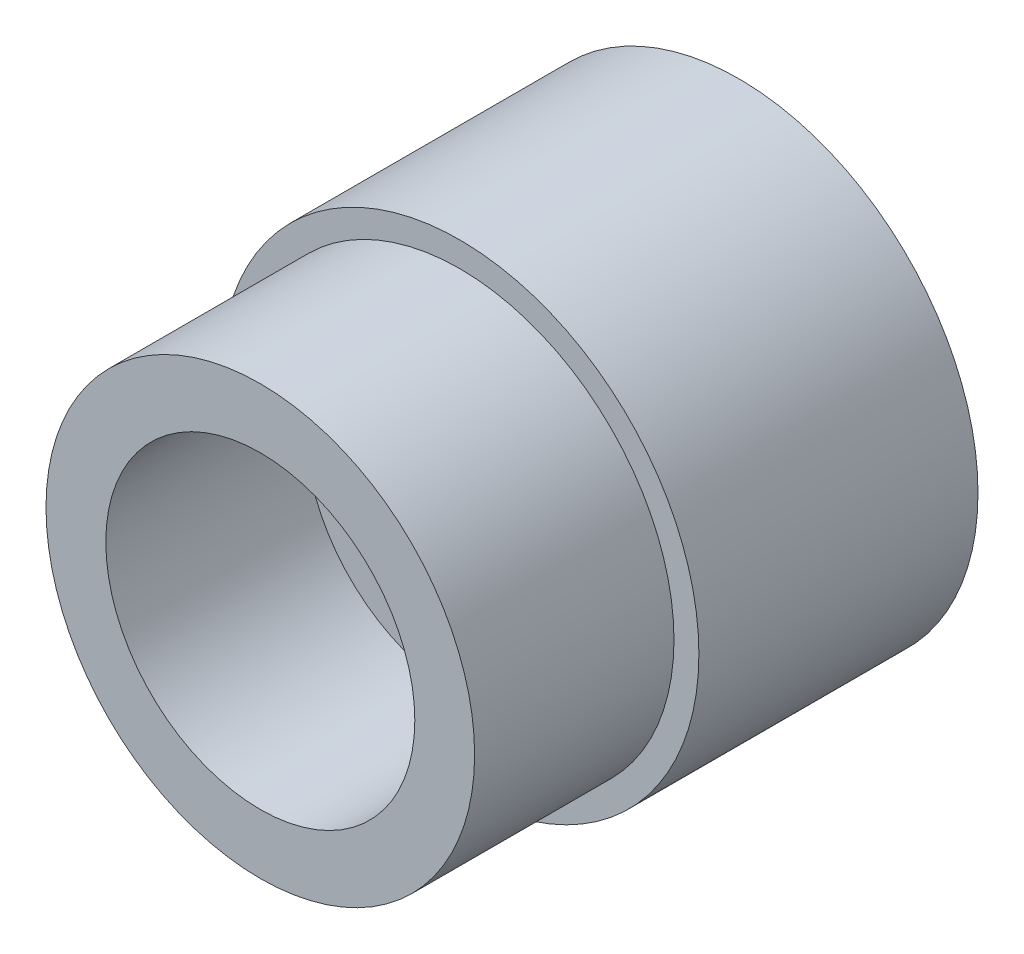
ISO-10303-21;
HEADER;
FILE_DESCRIPTION(('STEP AP214'),'2;1');
FILE_NAME('part.step','',(''),(''),'','','');
FILE_SCHEMA(('AUTOMOTIVE_DESIGN { 1 0 10303 214 1 1 1 1 }'));
ENDSEC;
DATA;
#1=APPLICATION_CONTEXT('core data for automotive mechanical design processes');
#2=APPLICATION_PROTOCOL_DEFINITION('international standard','automotive_design',2000,#1);
#3=PRODUCT_CONTEXT('',#1,'mechanical');
#4=PRODUCT('Part','Part','',(#3));
#5=PRODUCT_RELATED_PRODUCT_CATEGORY('part','',(#4));
#6=PRODUCT_DEFINITION_FORMATION('','',#4);
#7=PRODUCT_DEFINITION_CONTEXT('part definition',#1,'design');
#8=PRODUCT_DEFINITION('design','',#6,#7);
#9=PRODUCT_DEFINITION_SHAPE('','',#8);
#10=(LENGTH_UNIT() NAMED_UNIT(*) SI_UNIT(.MILLI.,.METRE.));
#11=(NAMED_UNIT(*) PLANE_ANGLE_UNIT() SI_UNIT($,.RADIAN.));
#12=(NAMED_UNIT(*) SI_UNIT($,.STERADIAN.) SOLID_ANGLE_UNIT());
#13=UNCERTAINTY_MEASURE_WITH_UNIT(LENGTH_MEASURE(1.E-05),#10,'distance_accuracy_value','');
#14=(GEOMETRIC_REPRESENTATION_CONTEXT(3) GLOBAL_UNCERTAINTY_ASSIGNED_CONTEXT((#13)) GLOBAL_UNIT_ASSIGNED_CONTEXT((#10,
#11,#12)) REPRESENTATION_CONTEXT('',''));
#15=CARTESIAN_POINT('',(0.,0.,0.));
#16=DIRECTION('',(0.,0.,1.));
#17=DIRECTION('',(1.,0.,0.));
#18=AXIS2_PLACEMENT_3D('',#15,#16,#17);
#19=CARTESIAN_POINT('',(0.,0.,28.));
#20=DIRECTION('',(0.,0.,1.));
#21=DIRECTION('',(1.,0.,0.));
#22=AXIS2_PLACEMENT_3D('',#19,#20,#21);
#23=PLANE('',#22);
#24=CARTESIAN_POINT('',(0.,0.,28.));
#25=DIRECTION('',(0.,0.,1.));
#26=DIRECTION('',(1.,0.,0.));
#27=AXIS2_PLACEMENT_3D('',#24,#25,#26);
#28=CIRCLE('',#27,24.);
#29=CARTESIAN_POINT('',(24.,0.,28.));
#30=VERTEX_POINT('',#29);
#31=EDGE_CURVE('E11',#30,#30,#28,.T.);
#32=ORIENTED_EDGE('',*,*,#31,.T.);
#33=EDGE_LOOP('',(#32));
#34=FACE_BOUND('',#33,.T.);
#35=CARTESIAN_POINT('',(0.,0.,28.));
#36=DIRECTION('',(0.,0.,-1.));
#37=DIRECTION('',(1.,0.,0.));
#38=AXIS2_PLACEMENT_3D('',#35,#36,#37);
#39=CIRCLE('',#38,21.5);
#40=CARTESIAN_POINT('',(-21.5,0.,28.));
#41=VERTEX_POINT('',#40);
#42=EDGE_CURVE('E93',#41,#41,#39,.T.);
#43=ORIENTED_EDGE('',*,*,#42,.T.);
#44=EDGE_LOOP('',(#43));
#45=FACE_BOUND('',#44,.T.);
#46=ADVANCED_FACE('F16',(#34,#45),#23,.T.);
#47=CARTESIAN_POINT('',(0.,0.,0.));
#48=DIRECTION('',(0.,0.,-1.));
#49=DIRECTION('',(-1.,0.,0.));
#50=AXIS2_PLACEMENT_3D('',#47,#48,#49);
#51=PLANE('',#50);
#52=CARTESIAN_POINT('',(0.,0.,0.));
#53=DIRECTION('',(0.,0.,-1.));
#54=DIRECTION('',(1.,0.,0.));
#55=AXIS2_PLACEMENT_3D('',#52,#53,#54);
#56=CIRCLE('',#55,24.);
#57=CARTESIAN_POINT('',(24.,0.,0.));
#58=VERTEX_POINT('',#57);
#59=EDGE_CURVE('E25',#58,#58,#56,.T.);
#60=ORIENTED_EDGE('',*,*,#59,.T.);
#61=EDGE_LOOP('',(#60));
#62=FACE_BOUND('',#61,.T.);
#63=CARTESIAN_POINT('',(0.,0.,0.));
#64=DIRECTION('',(0.,0.,1.));
#65=DIRECTION('',(-1.,0.,0.));
#66=AXIS2_PLACEMENT_3D('',#63,#64,#65);
#67=CIRCLE('',#66,19.);
#68=CARTESIAN_POINT('',(-19.,0.,0.));
#69=VERTEX_POINT('',#68);
#70=EDGE_CURVE('E108',#69,#69,#67,.T.);
#71=ORIENTED_EDGE('',*,*,#70,.T.);
#72=EDGE_LOOP('',(#71));
#73=FACE_BOUND('',#72,.T.);
#74=ADVANCED_FACE('F174',(#62,#73),#51,.T.);
#75=CARTESIAN_POINT('',(0.,0.,14.));
#76=DIRECTION('',(0.,0.,-1.));
#77=DIRECTION('',(1.,0.,0.));
#78=AXIS2_PLACEMENT_3D('',#75,#76,#77);
#79=CYLINDRICAL_SURFACE('',#78,24.);
#80=ORIENTED_EDGE('',*,*,#31,.F.);
#81=EDGE_LOOP('',(#80));
#82=FACE_BOUND('',#81,.T.);
#83=ORIENTED_EDGE('',*,*,#59,.F.);
#84=EDGE_LOOP('',(#83));
#85=FACE_BOUND('',#84,.T.);
#86=ADVANCED_FACE('F179',(#82,#85),#79,.T.);
#87=CARTESIAN_POINT('',(0.,0.,48.));
#88=DIRECTION('',(0.,0.,1.));
#89=DIRECTION('',(1.,0.,0.));
#90=AXIS2_PLACEMENT_3D('',#87,#88,#89);
#91=PLANE('',#90);
#92=CARTESIAN_POINT('',(0.,0.,48.));
#93=DIRECTION('',(0.,0.,1.));
#94=DIRECTION('',(1.,0.,0.));
#95=AXIS2_PLACEMENT_3D('',#92,#93,#94);
#96=CIRCLE('',#95,21.5);
#97=CARTESIAN_POINT('',(21.5,0.,48.));
#98=VERTEX_POINT('',#97);
#99=EDGE_CURVE('E90',#98,#98,#96,.T.);
#100=ORIENTED_EDGE('',*,*,#99,.T.);
#101=EDGE_LOOP('',(#100));
#102=FACE_BOUND('',#101,.T.);
#103=CARTESIAN_POINT('',(0.,0.,48.));
#104=DIRECTION('',(0.,0.,-1.));
#105=DIRECTION('',(1.,0.,0.));
#106=AXIS2_PLACEMENT_3D('',#103,#104,#105);
#107=CIRCLE('',#106,15.5);
#108=CARTESIAN_POINT('',(15.5,0.,48.));
#109=VERTEX_POINT('',#108);
#110=EDGE_CURVE('E96',#109,#109,#107,.T.);
#111=ORIENTED_EDGE('',*,*,#110,.T.);
#112=EDGE_LOOP('',(#111));
#113=FACE_BOUND('',#112,.T.);
#114=ADVANCED_FACE('F187',(#102,#113),#91,.T.);
#115=CARTESIAN_POINT('',(0.,0.,24.));
#116=DIRECTION('',(0.,0.,-1.));
#117=DIRECTION('',(1.,0.,0.));
#118=AXIS2_PLACEMENT_3D('',#115,#116,#117);
#119=CYLINDRICAL_SURFACE('',#118,21.5);
#120=ORIENTED_EDGE('',*,*,#42,.F.);
#121=EDGE_LOOP('',(#120));
#122=FACE_BOUND('',#121,.T.);
#123=ORIENTED_EDGE('',*,*,#99,.F.);
#124=EDGE_LOOP('',(#123));
#125=FACE_BOUND('',#124,.T.);
#126=ADVANCED_FACE('F191',(#122,#125),#119,.T.);
#127=CARTESIAN_POINT('',(0.,0.,24.));
#128=DIRECTION('',(0.,0.,-1.));
#129=DIRECTION('',(1.,0.,0.));
#130=AXIS2_PLACEMENT_3D('',#127,#128,#129);
#131=CYLINDRICAL_SURFACE('',#130,12.7);
#132=CARTESIAN_POINT('',(0.,0.,28.));
#133=DIRECTION('',(0.,0.,1.));
#134=DIRECTION('',(1.,0.,0.));
#135=AXIS2_PLACEMENT_3D('',#132,#133,#134);
#136=CIRCLE('',#135,12.7);
#137=CARTESIAN_POINT('',(-12.7,0.,28.));
#138=VERTEX_POINT('',#137);
#139=EDGE_CURVE('E94',#138,#138,#136,.T.);
#140=ORIENTED_EDGE('',*,*,#139,.T.);
#141=EDGE_LOOP('',(#140));
#142=FACE_BOUND('',#141,.T.);
#143=CARTESIAN_POINT('',(0.,0.,18.));
#144=DIRECTION('',(0.,0.,-1.));
#145=DIRECTION('',(1.,0.,0.));
#146=AXIS2_PLACEMENT_3D('',#143,#144,#145);
#147=CIRCLE('',#146,12.7);
#148=CARTESIAN_POINT('',(-12.7,0.,18.));
#149=VERTEX_POINT('',#148);
#150=EDGE_CURVE('E123',#149,#149,#147,.T.);
#151=ORIENTED_EDGE('',*,*,#150,.T.);
#152=EDGE_LOOP('',(#151));
#153=FACE_BOUND('',#152,.T.);
#154=ADVANCED_FACE('F193',(#142,#153),#131,.F.);
#155=CARTESIAN_POINT('',(0.,0.,28.));
#156=DIRECTION('',(0.,0.,-1.));
#157=DIRECTION('',(-1.,0.,0.));
#158=AXIS2_PLACEMENT_3D('',#155,#156,#157);
#159=PLANE('',#158);
#160=CARTESIAN_POINT('',(0.,0.,28.));
#161=DIRECTION('',(0.,0.,-1.));
#162=DIRECTION('',(1.,0.,0.));
#163=AXIS2_PLACEMENT_3D('',#160,#161,#162);
#164=CIRCLE('',#163,15.5);
#165=CARTESIAN_POINT('',(15.5,0.,28.));
#166=VERTEX_POINT('',#165);
#167=EDGE_CURVE('E102',#166,#166,#164,.T.);
#168=ORIENTED_EDGE('',*,*,#167,.F.);
#169=EDGE_LOOP('',(#168));
#170=FACE_BOUND('',#169,.T.);
#171=ORIENTED_EDGE('',*,*,#139,.F.);
#172=EDGE_LOOP('',(#171));
#173=FACE_BOUND('',#172,.T.);
#174=ADVANCED_FACE('F199',(#170,#173),#159,.F.);
#175=CARTESIAN_POINT('',(0.,0.,38.));
#176=DIRECTION('',(0.,0.,-1.));
#177=DIRECTION('',(1.,0.,0.));
#178=AXIS2_PLACEMENT_3D('',#175,#176,#177);
#179=CYLINDRICAL_SURFACE('',#178,15.5);
#180=ORIENTED_EDGE('',*,*,#110,.F.);
#181=EDGE_LOOP('',(#180));
#182=FACE_BOUND('',#181,.T.);
#183=ORIENTED_EDGE('',*,*,#167,.T.);
#184=EDGE_LOOP('',(#183));
#185=FACE_BOUND('',#184,.T.);
#186=ADVANCED_FACE('F217',(#182,#185),#179,.F.);
#187=CARTESIAN_POINT('',(0.,0.,0.75));
#188=DIRECTION('',(0.,0.,1.));
#189=DIRECTION('',(-1.,0.,0.));
#190=AXIS2_PLACEMENT_3D('',#187,#188,#189);
#191=CYLINDRICAL_SURFACE('',#190,19.);
#192=CARTESIAN_POINT('',(0.,0.,1.5));
#193=DIRECTION('',(0.,0.,-1.));
#194=DIRECTION('',(-1.,0.,0.));
#195=AXIS2_PLACEMENT_3D('',#192,#193,#194);
#196=CIRCLE('',#195,19.);
#197=CARTESIAN_POINT('',(-19.,0.,1.5));
#198=VERTEX_POINT('',#197);
#199=EDGE_CURVE('E99',#198,#198,#196,.T.);
#200=ORIENTED_EDGE('',*,*,#199,.F.);
#201=EDGE_LOOP('',(#200));
#202=FACE_BOUND('',#201,.T.);
#203=ORIENTED_EDGE('',*,*,#70,.F.);
#204=EDGE_LOOP('',(#203));
#205=FACE_BOUND('',#204,.T.);
#206=ADVANCED_FACE('F214',(#202,#205),#191,.F.);
#207=CARTESIAN_POINT('',(-17.75,0.,1.5));
#208=DIRECTION('',(0.,0.,1.));
#209=DIRECTION('',(1.,0.,0.));
#210=AXIS2_PLACEMENT_3D('',#207,#208,#209);
#211=PLANE('',#210);
#212=CARTESIAN_POINT('',(0.,0.,1.5));
#213=DIRECTION('',(0.,0.,-1.));
#214=DIRECTION('',(-1.,0.,0.));
#215=AXIS2_PLACEMENT_3D('',#212,#213,#214);
#216=CIRCLE('',#215,16.5);
#217=CARTESIAN_POINT('',(-16.5,0.,1.5));
#218=VERTEX_POINT('',#217);
#219=EDGE_CURVE('E97',#218,#218,#216,.T.);
#220=ORIENTED_EDGE('',*,*,#219,.F.);
#221=EDGE_LOOP('',(#220));
#222=FACE_BOUND('',#221,.T.);
#223=ORIENTED_EDGE('',*,*,#199,.T.);
#224=EDGE_LOOP('',(#223));
#225=FACE_BOUND('',#224,.T.);
#226=ADVANCED_FACE('F216',(#222,#225),#211,.F.);
#227=CARTESIAN_POINT('',(0.,0.,2.75));
#228=DIRECTION('',(0.,0.,1.));
#229=DIRECTION('',(-1.,0.,0.));
#230=AXIS2_PLACEMENT_3D('',#227,#228,#229);
#231=CYLINDRICAL_SURFACE('',#230,16.5);
#232=CARTESIAN_POINT('',(0.,0.,4.));
#233=DIRECTION('',(0.,0.,-1.));
#234=DIRECTION('',(-1.,0.,0.));
#235=AXIS2_PLACEMENT_3D('',#232,#233,#234);
#236=CIRCLE('',#235,16.5);
#237=CARTESIAN_POINT('',(-16.5,0.,4.));
#238=VERTEX_POINT('',#237);
#239=EDGE_CURVE('E20',#238,#238,#236,.T.);
#240=ORIENTED_EDGE('',*,*,#239,.F.);
#241=EDGE_LOOP('',(#240));
#242=FACE_BOUND('',#241,.T.);
#243=ORIENTED_EDGE('',*,*,#219,.T.);
#244=EDGE_LOOP('',(#243));
#245=FACE_BOUND('',#244,.T.);
#246=ADVANCED_FACE('F267',(#242,#245),#231,.F.);
#247=CARTESIAN_POINT('',(-19.,0.,4.));
#248=DIRECTION('',(0.,0.,-1.));
#249=DIRECTION('',(-1.,0.,0.));
#250=AXIS2_PLACEMENT_3D('',#247,#248,#249);
#251=PLANE('',#250);
#252=CARTESIAN_POINT('',(0.,0.,4.));
#253=DIRECTION('',(0.,0.,-1.));
#254=DIRECTION('',(-1.,0.,0.));
#255=AXIS2_PLACEMENT_3D('',#252,#253,#254);
#256=CIRCLE('',#255,21.5);
#257=CARTESIAN_POINT('',(-21.5,0.,4.));
#258=VERTEX_POINT('',#257);
#259=EDGE_CURVE('E119',#258,#258,#256,.T.);
#260=ORIENTED_EDGE('',*,*,#259,.F.);
#261=EDGE_LOOP('',(#260));
#262=FACE_BOUND('',#261,.T.);
#263=ORIENTED_EDGE('',*,*,#239,.T.);
#264=EDGE_LOOP('',(#263));
#265=FACE_BOUND('',#264,.T.);
#266=ADVANCED_FACE('F18',(#262,#265),#251,.F.);
#267=CARTESIAN_POINT('',(0.,0.,5.5));
#268=DIRECTION('',(0.,0.,1.));
#269=DIRECTION('',(-1.,0.,0.));
#270=AXIS2_PLACEMENT_3D('',#267,#268,#269);
#271=CYLINDRICAL_SURFACE('',#270,21.5);
#272=CARTESIAN_POINT('',(0.,0.,7.));
#273=DIRECTION('',(0.,0.,-1.));
#274=DIRECTION('',(-1.,0.,0.));
#275=AXIS2_PLACEMENT_3D('',#272,#273,#274);
#276=CIRCLE('',#275,21.5);
#277=CARTESIAN_POINT('',(-21.5,0.,7.));
#278=VERTEX_POINT('',#277);
#279=EDGE_CURVE('E122',#278,#278,#276,.T.);
#280=ORIENTED_EDGE('',*,*,#279,.F.);
#281=EDGE_LOOP('',(#280));
#282=FACE_BOUND('',#281,.T.);
#283=ORIENTED_EDGE('',*,*,#259,.T.);
#284=EDGE_LOOP('',(#283));
#285=FACE_BOUND('',#284,.T.);
#286=ADVANCED_FACE('F169',(#282,#285),#271,.F.);
#287=CARTESIAN_POINT('',(-19.,0.,7.));
#288=DIRECTION('',(0.,0.,1.));
#289=DIRECTION('',(1.,0.,0.));
#290=AXIS2_PLACEMENT_3D('',#287,#288,#289);
#291=PLANE('',#290);
#292=CARTESIAN_POINT('',(0.,0.,7.));
#293=DIRECTION('',(0.,0.,-1.));
#294=DIRECTION('',(-1.,0.,0.));
#295=AXIS2_PLACEMENT_3D('',#292,#293,#294);
#296=CIRCLE('',#295,16.5);
#297=CARTESIAN_POINT('',(-16.5,0.,7.));
#298=VERTEX_POINT('',#297);
#299=EDGE_CURVE('E106',#298,#298,#296,.T.);
#300=ORIENTED_EDGE('',*,*,#299,.F.);
#301=EDGE_LOOP('',(#300));
#302=FACE_BOUND('',#301,.T.);
#303=ORIENTED_EDGE('',*,*,#279,.T.);
#304=EDGE_LOOP('',(#303));
#305=FACE_BOUND('',#304,.T.);
#306=ADVANCED_FACE('F163',(#302,#305),#291,.F.);
#307=CARTESIAN_POINT('',(0.,0.,8.65));
#308=DIRECTION('',(0.,0.,1.));
#309=DIRECTION('',(-1.,0.,0.));
#310=AXIS2_PLACEMENT_3D('',#307,#308,#309);
#311=CYLINDRICAL_SURFACE('',#310,16.5);
#312=CARTESIAN_POINT('',(0.,0.,10.3));
#313=DIRECTION('',(0.,0.,-1.));
#314=DIRECTION('',(-1.,0.,0.));
#315=AXIS2_PLACEMENT_3D('',#312,#313,#314);
#316=CIRCLE('',#315,16.5);
#317=CARTESIAN_POINT('',(-16.5,0.,10.3));
#318=VERTEX_POINT('',#317);
#319=EDGE_CURVE('E103',#318,#318,#316,.T.);
#320=ORIENTED_EDGE('',*,*,#319,.F.);
#321=EDGE_LOOP('',(#320));
#322=FACE_BOUND('',#321,.T.);
#323=ORIENTED_EDGE('',*,*,#299,.T.);
#324=EDGE_LOOP('',(#323));
#325=FACE_BOUND('',#324,.T.);
#326=ADVANCED_FACE('F158',(#322,#325),#311,.F.);
#327=CARTESIAN_POINT('',(-19.,0.,10.3));
#328=DIRECTION('',(0.,0.,-1.));
#329=DIRECTION('',(-1.,0.,0.));
#330=AXIS2_PLACEMENT_3D('',#327,#328,#329);
#331=PLANE('',#330);
#332=CARTESIAN_POINT('',(0.,0.,10.3));
#333=DIRECTION('',(0.,0.,-1.));
#334=DIRECTION('',(-1.,0.,0.));
#335=AXIS2_PLACEMENT_3D('',#332,#333,#334);
#336=CIRCLE('',#335,21.5);
#337=CARTESIAN_POINT('',(-21.5,0.,10.3));
#338=VERTEX_POINT('',#337);
#339=EDGE_CURVE('E107',#338,#338,#336,.T.);
#340=ORIENTED_EDGE('',*,*,#339,.F.);
#341=EDGE_LOOP('',(#340));
#342=FACE_BOUND('',#341,.T.);
#343=ORIENTED_EDGE('',*,*,#319,.T.);
#344=EDGE_LOOP('',(#343));
#345=FACE_BOUND('',#344,.T.);
#346=ADVANCED_FACE('F150',(#342,#345),#331,.F.);
#347=CARTESIAN_POINT('',(0.,0.,11.8));
#348=DIRECTION('',(0.,0.,1.));
#349=DIRECTION('',(-1.,0.,0.));
#350=AXIS2_PLACEMENT_3D('',#347,#348,#349);
#351=CYLINDRICAL_SURFACE('',#350,21.5);
#352=CARTESIAN_POINT('',(0.,0.,13.3));
#353=DIRECTION('',(0.,0.,-1.));
#354=DIRECTION('',(-1.,0.,0.));
#355=AXIS2_PLACEMENT_3D('',#352,#353,#354);
#356=CIRCLE('',#355,21.5);
#357=CARTESIAN_POINT('',(-21.5,0.,13.3));
#358=VERTEX_POINT('',#357);
#359=EDGE_CURVE('E118',#358,#358,#356,.T.);
#360=ORIENTED_EDGE('',*,*,#359,.F.);
#361=EDGE_LOOP('',(#360));
#362=FACE_BOUND('',#361,.T.);
#363=ORIENTED_EDGE('',*,*,#339,.T.);
#364=EDGE_LOOP('',(#363));
#365=FACE_BOUND('',#364,.T.);
#366=ADVANCED_FACE('F147',(#362,#365),#351,.F.);
#367=CARTESIAN_POINT('',(-19.375,0.,13.3));
#368=DIRECTION('',(0.,0.,1.));
#369=DIRECTION('',(1.,0.,0.));
#370=AXIS2_PLACEMENT_3D('',#367,#368,#369);
#371=PLANE('',#370);
#372=CARTESIAN_POINT('',(0.,0.,13.3));
#373=DIRECTION('',(0.,0.,-1.));
#374=DIRECTION('',(-1.,0.,0.));
#375=AXIS2_PLACEMENT_3D('',#372,#373,#374);
#376=CIRCLE('',#375,17.25);
#377=CARTESIAN_POINT('',(-17.25,0.,13.3));
#378=VERTEX_POINT('',#377);
#379=EDGE_CURVE('E127',#378,#378,#376,.T.);
#380=ORIENTED_EDGE('',*,*,#379,.F.);
#381=EDGE_LOOP('',(#380));
#382=FACE_BOUND('',#381,.T.);
#383=ORIENTED_EDGE('',*,*,#359,.T.);
#384=EDGE_LOOP('',(#383));
#385=FACE_BOUND('',#384,.T.);
#386=ADVANCED_FACE('F145',(#382,#385),#371,.F.);
#387=CARTESIAN_POINT('',(0.,0.,14.4));
#388=DIRECTION('',(0.,0.,1.));
#389=DIRECTION('',(-1.,0.,0.));
#390=AXIS2_PLACEMENT_3D('',#387,#388,#389);
#391=CYLINDRICAL_SURFACE('',#390,17.25);
#392=CARTESIAN_POINT('',(0.,0.,15.5));
#393=DIRECTION('',(0.,0.,-1.));
#394=DIRECTION('',(-1.,0.,0.));
#395=AXIS2_PLACEMENT_3D('',#392,#393,#394);
#396=CIRCLE('',#395,17.25);
#397=CARTESIAN_POINT('',(-17.25,0.,15.5));
#398=VERTEX_POINT('',#397);
#399=EDGE_CURVE('E114',#398,#398,#396,.T.);
#400=ORIENTED_EDGE('',*,*,#399,.F.);
#401=EDGE_LOOP('',(#400));
#402=FACE_BOUND('',#401,.T.);
#403=ORIENTED_EDGE('',*,*,#379,.T.);
#404=EDGE_LOOP('',(#403));
#405=FACE_BOUND('',#404,.T.);
#406=ADVANCED_FACE('F246',(#402,#405),#391,.F.);
#407=CARTESIAN_POINT('',(-19.375,0.,15.5));
#408=DIRECTION('',(0.,0.,-1.));
#409=DIRECTION('',(-1.,0.,0.));
#410=AXIS2_PLACEMENT_3D('',#407,#408,#409);
#411=PLANE('',#410);
#412=CARTESIAN_POINT('',(0.,0.,15.5));
#413=DIRECTION('',(0.,0.,-1.));
#414=DIRECTION('',(-1.,0.,0.));
#415=AXIS2_PLACEMENT_3D('',#412,#413,#414);
#416=CIRCLE('',#415,21.5);
#417=CARTESIAN_POINT('',(-21.5,0.,15.5));
#418=VERTEX_POINT('',#417);
#419=EDGE_CURVE('E111',#418,#418,#416,.T.);
#420=ORIENTED_EDGE('',*,*,#419,.F.);
#421=EDGE_LOOP('',(#420));
#422=FACE_BOUND('',#421,.T.);
#423=ORIENTED_EDGE('',*,*,#399,.T.);
#424=EDGE_LOOP('',(#423));
#425=FACE_BOUND('',#424,.T.);
#426=ADVANCED_FACE('F241',(#422,#425),#411,.F.);
#427=CARTESIAN_POINT('',(0.,0.,16.75));
#428=DIRECTION('',(0.,0.,1.));
#429=DIRECTION('',(-1.,0.,0.));
#430=AXIS2_PLACEMENT_3D('',#427,#428,#429);
#431=CYLINDRICAL_SURFACE('',#430,21.5);
#432=CARTESIAN_POINT('',(0.,0.,18.));
#433=DIRECTION('',(0.,0.,-1.));
#434=DIRECTION('',(-1.,0.,0.));
#435=AXIS2_PLACEMENT_3D('',#432,#433,#434);
#436=CIRCLE('',#435,21.5);
#437=CARTESIAN_POINT('',(-21.5,0.,18.));
#438=VERTEX_POINT('',#437);
#439=EDGE_CURVE('E84',#438,#438,#436,.T.);
#440=ORIENTED_EDGE('',*,*,#439,.F.);
#441=EDGE_LOOP('',(#440));
#442=FACE_BOUND('',#441,.T.);
#443=ORIENTED_EDGE('',*,*,#419,.T.);
#444=EDGE_LOOP('',(#443));
#445=FACE_BOUND('',#444,.T.);
#446=ADVANCED_FACE('F236',(#442,#445),#431,.F.);
#447=CARTESIAN_POINT('',(-19.5,0.,18.));
#448=DIRECTION('',(0.,0.,1.));
#449=DIRECTION('',(1.,0.,0.));
#450=AXIS2_PLACEMENT_3D('',#447,#448,#449);
#451=PLANE('',#450);
#452=CARTESIAN_POINT('',(0.,0.,18.));
#453=DIRECTION('',(0.,0.,-1.));
#454=DIRECTION('',(-1.,0.,0.));
#455=AXIS2_PLACEMENT_3D('',#452,#453,#454);
#456=CIRCLE('',#455,17.5);
#457=CARTESIAN_POINT('',(-17.5,0.,18.));
#458=VERTEX_POINT('',#457);
#459=EDGE_CURVE('E81',#458,#458,#456,.T.);
#460=ORIENTED_EDGE('',*,*,#459,.F.);
#461=EDGE_LOOP('',(#460));
#462=FACE_BOUND('',#461,.T.);
#463=ORIENTED_EDGE('',*,*,#439,.T.);
#464=EDGE_LOOP('',(#463));
#465=FACE_BOUND('',#464,.T.);
#466=ADVANCED_FACE('F233',(#462,#465),#451,.F.);
#467=CARTESIAN_POINT('',(0.,0.,17.4));
#468=DIRECTION('',(0.,0.,1.));
#469=DIRECTION('',(-1.,0.,0.));
#470=AXIS2_PLACEMENT_3D('',#467,#468,#469);
#471=CYLINDRICAL_SURFACE('',#470,17.5);
#472=CARTESIAN_POINT('',(0.,0.,16.8));
#473=DIRECTION('',(0.,0.,-1.));
#474=DIRECTION('',(-1.,0.,0.));
#475=AXIS2_PLACEMENT_3D('',#472,#473,#474);
#476=CIRCLE('',#475,17.5);
#477=CARTESIAN_POINT('',(-17.5,0.,16.8));
#478=VERTEX_POINT('',#477);
#479=EDGE_CURVE('E78',#478,#478,#476,.T.);
#480=ORIENTED_EDGE('',*,*,#479,.F.);
#481=EDGE_LOOP('',(#480));
#482=FACE_BOUND('',#481,.T.);
#483=ORIENTED_EDGE('',*,*,#459,.T.);
#484=EDGE_LOOP('',(#483));
#485=FACE_BOUND('',#484,.T.);
#486=ADVANCED_FACE('F204',(#482,#485),#471,.T.);
#487=CARTESIAN_POINT('',(-16.,0.,16.8));
#488=DIRECTION('',(0.,0.,1.));
#489=DIRECTION('',(1.,0.,0.));
#490=AXIS2_PLACEMENT_3D('',#487,#488,#489);
#491=PLANE('',#490);
#492=CARTESIAN_POINT('',(0.,0.,16.8));
#493=DIRECTION('',(0.,0.,-1.));
#494=DIRECTION('',(-1.,0.,0.));
#495=AXIS2_PLACEMENT_3D('',#492,#493,#494);
#496=CIRCLE('',#495,14.5);
#497=CARTESIAN_POINT('',(-14.5,0.,16.8));
#498=VERTEX_POINT('',#497);
#499=EDGE_CURVE('E82',#498,#498,#496,.T.);
#500=ORIENTED_EDGE('',*,*,#499,.F.);
#501=EDGE_LOOP('',(#500));
#502=FACE_BOUND('',#501,.T.);
#503=ORIENTED_EDGE('',*,*,#479,.T.);
#504=EDGE_LOOP('',(#503));
#505=FACE_BOUND('',#504,.T.);
#506=ADVANCED_FACE('F79',(#502,#505),#491,.F.);
#507=CARTESIAN_POINT('',(0.,0.,17.4));
#508=DIRECTION('',(0.,0.,1.));
#509=DIRECTION('',(-1.,0.,0.));
#510=AXIS2_PLACEMENT_3D('',#507,#508,#509);
#511=CYLINDRICAL_SURFACE('',#510,14.5);
#512=CARTESIAN_POINT('',(0.,0.,18.));
#513=DIRECTION('',(0.,0.,-1.));
#514=DIRECTION('',(-1.,0.,0.));
#515=AXIS2_PLACEMENT_3D('',#512,#513,#514);
#516=CIRCLE('',#515,14.5);
#517=CARTESIAN_POINT('',(-14.5,0.,18.));
#518=VERTEX_POINT('',#517);
#519=EDGE_CURVE('E86',#518,#518,#516,.T.);
#520=ORIENTED_EDGE('',*,*,#519,.F.);
#521=EDGE_LOOP('',(#520));
#522=FACE_BOUND('',#521,.T.);
#523=ORIENTED_EDGE('',*,*,#499,.T.);
#524=EDGE_LOOP('',(#523));
#525=FACE_BOUND('',#524,.T.);
#526=ADVANCED_FACE('F209',(#522,#525),#511,.F.);
#527=CARTESIAN_POINT('',(-13.6,0.,18.));
#528=DIRECTION('',(0.,0.,1.));
#529=DIRECTION('',(1.,0.,0.));
#530=AXIS2_PLACEMENT_3D('',#527,#528,#529);
#531=PLANE('',#530);
#532=ORIENTED_EDGE('',*,*,#519,.T.);
#533=EDGE_LOOP('',(#532));
#534=FACE_BOUND('',#533,.T.);
#535=ORIENTED_EDGE('',*,*,#150,.F.);
#536=EDGE_LOOP('',(#535));
#537=FACE_BOUND('',#536,.T.);
#538=ADVANCED_FACE('F225',(#534,#537),#531,.F.);
#539=CLOSED_SHELL('',(#46,#74,#86,#114,#126,#154,#174,#186,#206,#226,#246,#266,#286,#306,#326,
#346,#366,#386,#406,#426,#446,#466,#486,#506,#526,#538));
#540=MANIFOLD_SOLID_BREP('B1',#539);
#541=ADVANCED_BREP_SHAPE_REPRESENTATION('',(#18,#540),#14);
#542=SHAPE_DEFINITION_REPRESENTATION(#9,#541);
ENDSEC;
END-ISO-10303-21;
